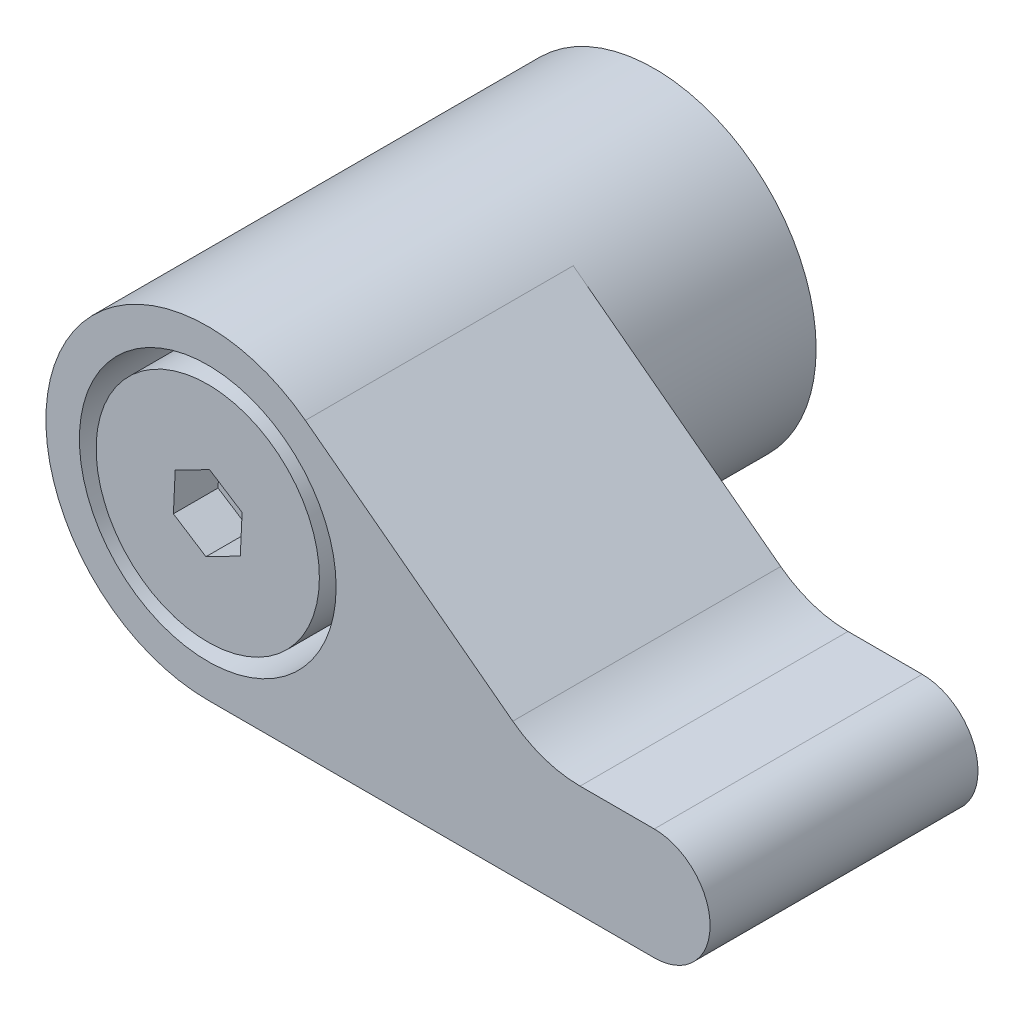
ISO-10303-21;
HEADER;
FILE_DESCRIPTION(('STEP AP214'),'2;1');
FILE_NAME('part.step','',(''),(''),'','','');
FILE_SCHEMA(('AUTOMOTIVE_DESIGN { 1 0 10303 214 1 1 1 1 }'));
ENDSEC;
DATA;
#1=APPLICATION_CONTEXT('core data for automotive mechanical design processes');
#2=APPLICATION_PROTOCOL_DEFINITION('international standard','automotive_design',2000,#1);
#3=PRODUCT_CONTEXT('',#1,'mechanical');
#4=PRODUCT('Part','Part','',(#3));
#5=PRODUCT_RELATED_PRODUCT_CATEGORY('part','',(#4));
#6=PRODUCT_DEFINITION_FORMATION('','',#4);
#7=PRODUCT_DEFINITION_CONTEXT('part definition',#1,'design');
#8=PRODUCT_DEFINITION('design','',#6,#7);
#9=PRODUCT_DEFINITION_SHAPE('','',#8);
#10=(LENGTH_UNIT() NAMED_UNIT(*) SI_UNIT(.MILLI.,.METRE.));
#11=(NAMED_UNIT(*) PLANE_ANGLE_UNIT() SI_UNIT($,.RADIAN.));
#12=(NAMED_UNIT(*) SI_UNIT($,.STERADIAN.) SOLID_ANGLE_UNIT());
#13=UNCERTAINTY_MEASURE_WITH_UNIT(LENGTH_MEASURE(1.E-05),#10,'distance_accuracy_value','');
#14=(GEOMETRIC_REPRESENTATION_CONTEXT(3) GLOBAL_UNCERTAINTY_ASSIGNED_CONTEXT((#13)) GLOBAL_UNIT_ASSIGNED_CONTEXT((#10,
#11,#12)) REPRESENTATION_CONTEXT('',''));
#15=CARTESIAN_POINT('',(0.,0.,0.));
#16=DIRECTION('',(0.,0.,1.));
#17=DIRECTION('',(1.,0.,0.));
#18=AXIS2_PLACEMENT_3D('',#15,#16,#17);
#19=CARTESIAN_POINT('',(0.,0.,10.));
#20=DIRECTION('',(0.,0.,1.));
#21=DIRECTION('',(1.,0.,0.));
#22=AXIS2_PLACEMENT_3D('',#19,#20,#21);
#23=PLANE('',#22);
#24=CARTESIAN_POINT('',(0.,0.,10.));
#25=DIRECTION('',(0.,0.,1.));
#26=DIRECTION('',(1.,0.,0.));
#27=AXIS2_PLACEMENT_3D('',#24,#25,#26);
#28=CIRCLE('',#27,5.75);
#29=CARTESIAN_POINT('',(5.75,0.,10.));
#30=VERTEX_POINT('',#29);
#31=EDGE_CURVE('E186',#30,#30,#28,.T.);
#32=ORIENTED_EDGE('',*,*,#31,.T.);
#33=EDGE_LOOP('',(#32));
#34=FACE_BOUND('',#33,.T.);
#35=CARTESIAN_POINT('',(0.,0.,10.));
#36=DIRECTION('',(0.,0.,1.));
#37=DIRECTION('',(1.,0.,0.));
#38=AXIS2_PLACEMENT_3D('',#35,#36,#37);
#39=CIRCLE('',#38,5.);
#40=CARTESIAN_POINT('',(5.,0.,10.));
#41=VERTEX_POINT('',#40);
#42=EDGE_CURVE('E172',#41,#41,#39,.T.);
#43=ORIENTED_EDGE('',*,*,#42,.F.);
#44=EDGE_LOOP('',(#43));
#45=FACE_BOUND('',#44,.T.);
#46=ADVANCED_FACE('F36',(#34,#45),#23,.T.);
#47=CARTESIAN_POINT('',(0.,0.,20.));
#48=DIRECTION('',(0.,0.,-1.));
#49=DIRECTION('',(-1.,0.,0.));
#50=AXIS2_PLACEMENT_3D('',#47,#48,#49);
#51=CYLINDRICAL_SURFACE('',#50,7.25);
#52=CARTESIAN_POINT('',(0.,0.,20.));
#53=DIRECTION('',(0.,0.,1.));
#54=DIRECTION('',(1.,0.,0.));
#55=AXIS2_PLACEMENT_3D('',#52,#53,#54);
#56=CIRCLE('',#55,7.25);
#57=CARTESIAN_POINT('',(4.3717142589399,5.78365061515489,20.));
#58=VERTEX_POINT('',#57);
#59=CARTESIAN_POINT('',(0.,-7.25,20.));
#60=VERTEX_POINT('',#59);
#61=EDGE_CURVE('E224',#58,#60,#56,.T.);
#62=ORIENTED_EDGE('',*,*,#61,.F.);
#63=DIRECTION('',(0.,0.,1.));
#64=VECTOR('',#63,1.);
#65=CARTESIAN_POINT('',(4.3717142589399,5.78365061515489,8.));
#66=LINE('',#65,#64);
#67=CARTESIAN_POINT('',(4.3717142589399,5.78365061515489,8.));
#68=VERTEX_POINT('',#67);
#69=EDGE_CURVE('E214',#68,#58,#66,.T.);
#70=ORIENTED_EDGE('',*,*,#69,.F.);
#71=CARTESIAN_POINT('',(0.,0.,8.));
#72=DIRECTION('',(0.,0.,1.));
#73=DIRECTION('',(1.,0.,0.));
#74=AXIS2_PLACEMENT_3D('',#71,#72,#73);
#75=CIRCLE('',#74,7.25);
#76=CARTESIAN_POINT('',(0.,-7.25,8.));
#77=VERTEX_POINT('',#76);
#78=EDGE_CURVE('E227',#77,#68,#75,.T.);
#79=ORIENTED_EDGE('',*,*,#78,.F.);
#80=DIRECTION('',(0.,0.,1.));
#81=VECTOR('',#80,1.);
#82=CARTESIAN_POINT('',(0.,-7.25,8.));
#83=LINE('',#82,#81);
#84=EDGE_CURVE('E204',#77,#60,#83,.T.);
#85=ORIENTED_EDGE('',*,*,#84,.T.);
#86=EDGE_LOOP('',(#62,#70,#79,#85));
#87=FACE_BOUND('',#86,.T.);
#88=CARTESIAN_POINT('',(0.,0.,0.));
#89=DIRECTION('',(0.,0.,1.));
#90=DIRECTION('',(1.,0.,0.));
#91=AXIS2_PLACEMENT_3D('',#88,#89,#90);
#92=CIRCLE('',#91,7.25);
#93=CARTESIAN_POINT('',(7.25,0.,0.));
#94=VERTEX_POINT('',#93);
#95=EDGE_CURVE('E217',#94,#94,#92,.T.);
#96=ORIENTED_EDGE('',*,*,#95,.T.);
#97=EDGE_LOOP('',(#96));
#98=FACE_BOUND('',#97,.T.);
#99=ADVANCED_FACE('F258',(#87,#98),#51,.T.);
#100=CARTESIAN_POINT('',(0.,0.,20.));
#101=DIRECTION('',(0.,0.,1.));
#102=DIRECTION('',(1.,0.,0.));
#103=AXIS2_PLACEMENT_3D('',#100,#101,#102);
#104=PLANE('',#103);
#105=CARTESIAN_POINT('',(0.,0.,20.));
#106=DIRECTION('',(0.,0.,1.));
#107=DIRECTION('',(1.,0.,0.));
#108=AXIS2_PLACEMENT_3D('',#105,#106,#107);
#109=CIRCLE('',#108,5.75);
#110=CARTESIAN_POINT('',(5.75,0.,20.));
#111=VERTEX_POINT('',#110);
#112=EDGE_CURVE('E185',#111,#111,#109,.T.);
#113=ORIENTED_EDGE('',*,*,#112,.F.);
#114=EDGE_LOOP('',(#113));
#115=FACE_BOUND('',#114,.T.);
#116=ORIENTED_EDGE('',*,*,#61,.T.);
#117=DIRECTION('',(1.,0.,0.));
#118=VECTOR('',#117,1.);
#119=CARTESIAN_POINT('',(0.,-7.25,20.));
#120=LINE('',#119,#118);
#121=CARTESIAN_POINT('',(20.,-7.25,20.));
#122=VERTEX_POINT('',#121);
#123=EDGE_CURVE('E189',#60,#122,#120,.T.);
#124=ORIENTED_EDGE('',*,*,#123,.T.);
#125=CARTESIAN_POINT('',(20.,-4.75,20.));
#126=DIRECTION('',(0.,0.,1.));
#127=DIRECTION('',(1.,0.,0.));
#128=AXIS2_PLACEMENT_3D('',#125,#126,#127);
#129=CIRCLE('',#128,2.5);
#130=CARTESIAN_POINT('',(20.,-2.25,20.));
#131=VERTEX_POINT('',#130);
#132=EDGE_CURVE('E207',#122,#131,#129,.T.);
#133=ORIENTED_EDGE('',*,*,#132,.T.);
#134=DIRECTION('',(-1.,0.,0.));
#135=VECTOR('',#134,1.);
#136=CARTESIAN_POINT('',(20.,-2.25,20.));
#137=LINE('',#136,#135);
#138=CARTESIAN_POINT('',(16.6770874055258,-2.25,20.));
#139=VERTEX_POINT('',#138);
#140=EDGE_CURVE('E210',#131,#139,#137,.T.);
#141=ORIENTED_EDGE('',*,*,#140,.T.);
#142=CARTESIAN_POINT('',(16.6770874055258,2.75,20.));
#143=DIRECTION('',(0.,0.,1.));
#144=DIRECTION('',(1.,0.,0.));
#145=AXIS2_PLACEMENT_3D('',#142,#143,#144);
#146=CIRCLE('',#145,5.);
#147=CARTESIAN_POINT('',(13.6621120545327,-1.23872456217579,20.));
#148=VERTEX_POINT('',#147);
#149=EDGE_CURVE('E44',#139,#148,#146,.F.);
#150=ORIENTED_EDGE('',*,*,#149,.T.);
#151=DIRECTION('',(-0.797744912435157,0.602995070198607,0.));
#152=VECTOR('',#151,1.);
#153=CARTESIAN_POINT('',(15.,-2.25,20.));
#154=LINE('',#153,#152);
#155=EDGE_CURVE('E196',#148,#58,#154,.T.);
#156=ORIENTED_EDGE('',*,*,#155,.T.);
#157=EDGE_LOOP('',(#116,#124,#133,#141,#150,#156));
#158=FACE_BOUND('',#157,.T.);
#159=ADVANCED_FACE('F236',(#115,#158),#104,.T.);
#160=CARTESIAN_POINT('',(0.,0.,0.));
#161=DIRECTION('',(0.,0.,1.));
#162=DIRECTION('',(1.,0.,0.));
#163=AXIS2_PLACEMENT_3D('',#160,#161,#162);
#164=PLANE('',#163);
#165=ORIENTED_EDGE('',*,*,#95,.F.);
#166=EDGE_LOOP('',(#165));
#167=FACE_BOUND('',#166,.T.);
#168=ADVANCED_FACE('F263',(#167),#164,.F.);
#169=CARTESIAN_POINT('',(0.,0.,8.));
#170=DIRECTION('',(0.,0.,1.));
#171=DIRECTION('',(1.,0.,0.));
#172=AXIS2_PLACEMENT_3D('',#169,#170,#171);
#173=PLANE('',#172);
#174=DIRECTION('',(1.,0.,0.));
#175=VECTOR('',#174,1.);
#176=CARTESIAN_POINT('',(0.,-7.25,8.));
#177=LINE('',#176,#175);
#178=CARTESIAN_POINT('',(20.,-7.25,8.));
#179=VERTEX_POINT('',#178);
#180=EDGE_CURVE('E192',#77,#179,#177,.T.);
#181=ORIENTED_EDGE('',*,*,#180,.F.);
#182=ORIENTED_EDGE('',*,*,#78,.T.);
#183=DIRECTION('',(-0.797744912435157,0.602995070198607,0.));
#184=VECTOR('',#183,1.);
#185=CARTESIAN_POINT('',(15.,-2.25,8.));
#186=LINE('',#185,#184);
#187=CARTESIAN_POINT('',(13.6621120545327,-1.23872456217579,8.));
#188=VERTEX_POINT('',#187);
#189=EDGE_CURVE('E202',#188,#68,#186,.T.);
#190=ORIENTED_EDGE('',*,*,#189,.F.);
#191=CARTESIAN_POINT('',(16.6770874055258,2.75,8.));
#192=DIRECTION('',(0.,0.,1.));
#193=DIRECTION('',(1.,0.,0.));
#194=AXIS2_PLACEMENT_3D('',#191,#192,#193);
#195=CIRCLE('',#194,5.);
#196=CARTESIAN_POINT('',(16.6770874055258,-2.25,8.));
#197=VERTEX_POINT('',#196);
#198=EDGE_CURVE('E11',#188,#197,#195,.T.);
#199=ORIENTED_EDGE('',*,*,#198,.T.);
#200=DIRECTION('',(-1.,0.,0.));
#201=VECTOR('',#200,1.);
#202=CARTESIAN_POINT('',(20.,-2.25,8.));
#203=LINE('',#202,#201);
#204=CARTESIAN_POINT('',(20.,-2.25,8.));
#205=VERTEX_POINT('',#204);
#206=EDGE_CURVE('E199',#205,#197,#203,.T.);
#207=ORIENTED_EDGE('',*,*,#206,.F.);
#208=CARTESIAN_POINT('',(20.,-4.75,8.));
#209=DIRECTION('',(0.,0.,1.));
#210=DIRECTION('',(1.,0.,0.));
#211=AXIS2_PLACEMENT_3D('',#208,#209,#210);
#212=CIRCLE('',#211,2.5);
#213=EDGE_CURVE('E195',#179,#205,#212,.T.);
#214=ORIENTED_EDGE('',*,*,#213,.F.);
#215=EDGE_LOOP('',(#181,#182,#190,#199,#207,#214));
#216=FACE_BOUND('',#215,.T.);
#217=ADVANCED_FACE('F247',(#216),#173,.F.);
#218=CARTESIAN_POINT('',(15.,-2.25,8.));
#219=DIRECTION('',(0.602995070198607,0.797744912435157,0.));
#220=DIRECTION('',(-0.797744912435158,0.602995070198607,0.));
#221=AXIS2_PLACEMENT_3D('',#218,#219,#220);
#222=PLANE('',#221);
#223=ORIENTED_EDGE('',*,*,#155,.F.);
#224=DIRECTION('',(0.,0.,1.));
#225=VECTOR('',#224,1.);
#226=CARTESIAN_POINT('',(13.6621120545327,-1.23872456217579,8.));
#227=LINE('',#226,#225);
#228=EDGE_CURVE('E59',#148,#188,#227,.F.);
#229=ORIENTED_EDGE('',*,*,#228,.T.);
#230=ORIENTED_EDGE('',*,*,#189,.T.);
#231=ORIENTED_EDGE('',*,*,#69,.T.);
#232=EDGE_LOOP('',(#223,#229,#230,#231));
#233=FACE_BOUND('',#232,.T.);
#234=ADVANCED_FACE('F240',(#233),#222,.T.);
#235=CARTESIAN_POINT('',(20.,-2.25,8.));
#236=DIRECTION('',(0.,1.,0.));
#237=DIRECTION('',(0.,0.,1.));
#238=AXIS2_PLACEMENT_3D('',#235,#236,#237);
#239=PLANE('',#238);
#240=ORIENTED_EDGE('',*,*,#206,.T.);
#241=DIRECTION('',(0.,0.,1.));
#242=VECTOR('',#241,1.);
#243=CARTESIAN_POINT('',(16.6770874055258,-2.25,20.));
#244=LINE('',#243,#242);
#245=EDGE_CURVE('E232',#197,#139,#244,.T.);
#246=ORIENTED_EDGE('',*,*,#245,.T.);
#247=ORIENTED_EDGE('',*,*,#140,.F.);
#248=DIRECTION('',(0.,0.,1.));
#249=VECTOR('',#248,1.);
#250=CARTESIAN_POINT('',(20.,-2.25,8.));
#251=LINE('',#250,#249);
#252=EDGE_CURVE('E218',#205,#131,#251,.T.);
#253=ORIENTED_EDGE('',*,*,#252,.F.);
#254=EDGE_LOOP('',(#240,#246,#247,#253));
#255=FACE_BOUND('',#254,.T.);
#256=ADVANCED_FACE('F250',(#255),#239,.T.);
#257=CARTESIAN_POINT('',(20.,-4.75,8.));
#258=DIRECTION('',(0.,0.,1.));
#259=DIRECTION('',(1.,0.,0.));
#260=AXIS2_PLACEMENT_3D('',#257,#258,#259);
#261=CYLINDRICAL_SURFACE('',#260,2.5);
#262=ORIENTED_EDGE('',*,*,#132,.F.);
#263=DIRECTION('',(0.,0.,1.));
#264=VECTOR('',#263,1.);
#265=CARTESIAN_POINT('',(20.,-7.25,8.));
#266=LINE('',#265,#264);
#267=EDGE_CURVE('E220',#179,#122,#266,.T.);
#268=ORIENTED_EDGE('',*,*,#267,.F.);
#269=ORIENTED_EDGE('',*,*,#213,.T.);
#270=ORIENTED_EDGE('',*,*,#252,.T.);
#271=EDGE_LOOP('',(#262,#268,#269,#270));
#272=FACE_BOUND('',#271,.T.);
#273=ADVANCED_FACE('F253',(#272),#261,.T.);
#274=CARTESIAN_POINT('',(0.,-7.25,8.));
#275=DIRECTION('',(0.,-1.,0.));
#276=DIRECTION('',(0.,0.,-1.));
#277=AXIS2_PLACEMENT_3D('',#274,#275,#276);
#278=PLANE('',#277);
#279=ORIENTED_EDGE('',*,*,#123,.F.);
#280=ORIENTED_EDGE('',*,*,#84,.F.);
#281=ORIENTED_EDGE('',*,*,#180,.T.);
#282=ORIENTED_EDGE('',*,*,#267,.T.);
#283=EDGE_LOOP('',(#279,#280,#281,#282));
#284=FACE_BOUND('',#283,.T.);
#285=ADVANCED_FACE('F256',(#284),#278,.T.);
#286=CARTESIAN_POINT('',(16.6770874055258,2.75,8.));
#287=DIRECTION('',(0.,0.,-1.));
#288=DIRECTION('',(-1.,0.,0.));
#289=AXIS2_PLACEMENT_3D('',#286,#287,#288);
#290=CYLINDRICAL_SURFACE('',#289,5.);
#291=ORIENTED_EDGE('',*,*,#198,.F.);
#292=ORIENTED_EDGE('',*,*,#228,.F.);
#293=ORIENTED_EDGE('',*,*,#149,.F.);
#294=ORIENTED_EDGE('',*,*,#245,.F.);
#295=EDGE_LOOP('',(#291,#292,#293,#294));
#296=FACE_BOUND('',#295,.T.);
#297=ADVANCED_FACE('F38',(#296),#290,.F.);
#298=CARTESIAN_POINT('',(0.,0.,10.));
#299=DIRECTION('',(0.,0.,1.));
#300=DIRECTION('',(1.,0.,0.));
#301=AXIS2_PLACEMENT_3D('',#298,#299,#300);
#302=CYLINDRICAL_SURFACE('',#301,5.75);
#303=ORIENTED_EDGE('',*,*,#31,.F.);
#304=EDGE_LOOP('',(#303));
#305=FACE_BOUND('',#304,.T.);
#306=ORIENTED_EDGE('',*,*,#112,.T.);
#307=EDGE_LOOP('',(#306));
#308=FACE_BOUND('',#307,.T.);
#309=ADVANCED_FACE('F283',(#305,#308),#302,.F.);
#310=CARTESIAN_POINT('',(0.,0.,34.142135623731));
#311=DIRECTION('',(0.,0.,-1.));
#312=DIRECTION('',(-1.,0.,0.));
#313=AXIS2_PLACEMENT_3D('',#310,#311,#312);
#314=CYLINDRICAL_SURFACE('',#313,5.);
#315=ORIENTED_EDGE('',*,*,#42,.T.);
#316=EDGE_LOOP('',(#315));
#317=FACE_BOUND('',#316,.T.);
#318=CARTESIAN_POINT('',(0.,0.,20.));
#319=DIRECTION('',(0.,0.,1.));
#320=DIRECTION('',(1.,0.,0.));
#321=AXIS2_PLACEMENT_3D('',#318,#319,#320);
#322=CIRCLE('',#321,5.);
#323=CARTESIAN_POINT('',(5.,0.,20.));
#324=VERTEX_POINT('',#323);
#325=EDGE_CURVE('E182',#324,#324,#322,.T.);
#326=ORIENTED_EDGE('',*,*,#325,.F.);
#327=EDGE_LOOP('',(#326));
#328=FACE_BOUND('',#327,.T.);
#329=ADVANCED_FACE('F285',(#317,#328),#314,.T.);
#330=CARTESIAN_POINT('',(0.,0.,20.));
#331=DIRECTION('',(0.,0.,1.));
#332=DIRECTION('',(1.,0.,0.));
#333=AXIS2_PLACEMENT_3D('',#330,#331,#332);
#334=PLANE('',#333);
#335=DIRECTION('',(0.888398265467521,0.459073547391155,0.));
#336=VECTOR('',#335,1.);
#337=CARTESIAN_POINT('',(-0.0807651454861721,-1.73016675244746,20.));
#338=LINE('',#337,#336);
#339=CARTESIAN_POINT('',(-0.0807651454861721,-1.73016675244746,20.));
#340=VERTEX_POINT('',#339);
#341=CARTESIAN_POINT('',(1.45798578765964,-0.935028043955102,20.));
#342=VERTEX_POINT('',#341);
#343=EDGE_CURVE('E51',#340,#342,#338,.T.);
#344=ORIENTED_EDGE('',*,*,#343,.F.);
#345=DIRECTION('',(0.841768486979941,-0.539838692877328,0.));
#346=VECTOR('',#345,1.);
#347=CARTESIAN_POINT('',(-1.53875093314581,-0.79513870849236,20.));
#348=LINE('',#347,#346);
#349=CARTESIAN_POINT('',(-1.53875093314581,-0.79513870849236,20.));
#350=VERTEX_POINT('',#349);
#351=EDGE_CURVE('E146',#350,#340,#348,.T.);
#352=ORIENTED_EDGE('',*,*,#351,.F.);
#353=DIRECTION('',(-0.0466297784875807,-0.998912240268483,0.));
#354=VECTOR('',#353,1.);
#355=CARTESIAN_POINT('',(-1.45798578765964,0.935028043955102,20.));
#356=LINE('',#355,#354);
#357=CARTESIAN_POINT('',(-1.45798578765964,0.935028043955102,20.));
#358=VERTEX_POINT('',#357);
#359=EDGE_CURVE('E149',#358,#350,#356,.T.);
#360=ORIENTED_EDGE('',*,*,#359,.F.);
#361=DIRECTION('',(-0.888398265467522,-0.459073547391155,0.));
#362=VECTOR('',#361,1.);
#363=CARTESIAN_POINT('',(0.0807651454861726,1.73016675244746,20.));
#364=LINE('',#363,#362);
#365=CARTESIAN_POINT('',(0.0807651454861726,1.73016675244746,20.));
#366=VERTEX_POINT('',#365);
#367=EDGE_CURVE('E165',#366,#358,#364,.T.);
#368=ORIENTED_EDGE('',*,*,#367,.F.);
#369=DIRECTION('',(-0.841768486979941,0.539838692877328,0.));
#370=VECTOR('',#369,1.);
#371=CARTESIAN_POINT('',(1.53875093314581,0.79513870849236,20.));
#372=LINE('',#371,#370);
#373=CARTESIAN_POINT('',(1.53875093314581,0.79513870849236,20.));
#374=VERTEX_POINT('',#373);
#375=EDGE_CURVE('E162',#374,#366,#372,.T.);
#376=ORIENTED_EDGE('',*,*,#375,.F.);
#377=DIRECTION('',(0.0466297784875807,0.998912240268483,0.));
#378=VECTOR('',#377,1.);
#379=CARTESIAN_POINT('',(1.45798578765964,-0.935028043955102,20.));
#380=LINE('',#379,#378);
#381=EDGE_CURVE('E160',#342,#374,#380,.T.);
#382=ORIENTED_EDGE('',*,*,#381,.F.);
#383=EDGE_LOOP('',(#344,#352,#360,#368,#376,#382));
#384=FACE_BOUND('',#383,.T.);
#385=ORIENTED_EDGE('',*,*,#325,.T.);
#386=EDGE_LOOP('',(#385));
#387=FACE_BOUND('',#386,.T.);
#388=ADVANCED_FACE('F281',(#384,#387),#334,.T.);
#389=CARTESIAN_POINT('',(-0.0807651454861721,-1.73016675244746,18.));
#390=DIRECTION('',(0.459073547391155,-0.888398265467521,0.));
#391=DIRECTION('',(0.888398265467522,0.459073547391155,0.));
#392=AXIS2_PLACEMENT_3D('',#389,#390,#391);
#393=PLANE('',#392);
#394=ORIENTED_EDGE('',*,*,#343,.T.);
#395=DIRECTION('',(0.,0.,1.));
#396=VECTOR('',#395,1.);
#397=CARTESIAN_POINT('',(1.45798578765964,-0.935028043955102,18.));
#398=LINE('',#397,#396);
#399=CARTESIAN_POINT('',(1.45798578765964,-0.935028043955102,18.));
#400=VERTEX_POINT('',#399);
#401=EDGE_CURVE('E123',#400,#342,#398,.T.);
#402=ORIENTED_EDGE('',*,*,#401,.F.);
#403=DIRECTION('',(0.888398265467521,0.459073547391155,0.));
#404=VECTOR('',#403,1.);
#405=CARTESIAN_POINT('',(-0.0807651454861721,-1.73016675244746,18.));
#406=LINE('',#405,#404);
#407=CARTESIAN_POINT('',(-0.0807651454861721,-1.73016675244746,18.));
#408=VERTEX_POINT('',#407);
#409=EDGE_CURVE('E127',#408,#400,#406,.T.);
#410=ORIENTED_EDGE('',*,*,#409,.F.);
#411=DIRECTION('',(0.,0.,1.));
#412=VECTOR('',#411,1.);
#413=CARTESIAN_POINT('',(-0.0807651454861721,-1.73016675244746,18.));
#414=LINE('',#413,#412);
#415=EDGE_CURVE('E170',#408,#340,#414,.T.);
#416=ORIENTED_EDGE('',*,*,#415,.T.);
#417=EDGE_LOOP('',(#394,#402,#410,#416));
#418=FACE_BOUND('',#417,.T.);
#419=ADVANCED_FACE('F125',(#418),#393,.F.);
#420=CARTESIAN_POINT('',(-1.53875093314581,-0.79513870849236,18.));
#421=DIRECTION('',(-0.539838692877328,-0.841768486979941,0.));
#422=DIRECTION('',(0.841768486979941,-0.539838692877328,0.));
#423=AXIS2_PLACEMENT_3D('',#420,#421,#422);
#424=PLANE('',#423);
#425=ORIENTED_EDGE('',*,*,#351,.T.);
#426=ORIENTED_EDGE('',*,*,#415,.F.);
#427=DIRECTION('',(0.841768486979941,-0.539838692877328,0.));
#428=VECTOR('',#427,1.);
#429=CARTESIAN_POINT('',(-1.53875093314581,-0.79513870849236,18.));
#430=LINE('',#429,#428);
#431=CARTESIAN_POINT('',(-1.53875093314581,-0.79513870849236,18.));
#432=VERTEX_POINT('',#431);
#433=EDGE_CURVE('E133',#432,#408,#430,.T.);
#434=ORIENTED_EDGE('',*,*,#433,.F.);
#435=DIRECTION('',(0.,0.,1.));
#436=VECTOR('',#435,1.);
#437=CARTESIAN_POINT('',(-1.53875093314581,-0.79513870849236,18.));
#438=LINE('',#437,#436);
#439=EDGE_CURVE('E173',#432,#350,#438,.T.);
#440=ORIENTED_EDGE('',*,*,#439,.T.);
#441=EDGE_LOOP('',(#425,#426,#434,#440));
#442=FACE_BOUND('',#441,.T.);
#443=ADVANCED_FACE('F324',(#442),#424,.F.);
#444=CARTESIAN_POINT('',(-1.45798578765964,0.935028043955102,18.));
#445=DIRECTION('',(-0.998912240268483,0.0466297784875807,0.));
#446=DIRECTION('',(-0.0466297784875807,-0.998912240268483,0.));
#447=AXIS2_PLACEMENT_3D('',#444,#445,#446);
#448=PLANE('',#447);
#449=ORIENTED_EDGE('',*,*,#359,.T.);
#450=ORIENTED_EDGE('',*,*,#439,.F.);
#451=DIRECTION('',(-0.0466297784875807,-0.998912240268483,0.));
#452=VECTOR('',#451,1.);
#453=CARTESIAN_POINT('',(-1.45798578765964,0.935028043955102,18.));
#454=LINE('',#453,#452);
#455=CARTESIAN_POINT('',(-1.45798578765964,0.935028043955102,18.));
#456=VERTEX_POINT('',#455);
#457=EDGE_CURVE('E156',#456,#432,#454,.T.);
#458=ORIENTED_EDGE('',*,*,#457,.F.);
#459=DIRECTION('',(0.,0.,1.));
#460=VECTOR('',#459,1.);
#461=CARTESIAN_POINT('',(-1.45798578765964,0.935028043955102,18.));
#462=LINE('',#461,#460);
#463=EDGE_CURVE('E175',#456,#358,#462,.T.);
#464=ORIENTED_EDGE('',*,*,#463,.T.);
#465=EDGE_LOOP('',(#449,#450,#458,#464));
#466=FACE_BOUND('',#465,.T.);
#467=ADVANCED_FACE('F331',(#466),#448,.F.);
#468=CARTESIAN_POINT('',(0.0807651454861726,1.73016675244746,18.));
#469=DIRECTION('',(-0.459073547391155,0.888398265467522,0.));
#470=DIRECTION('',(-0.888398265467522,-0.459073547391155,0.));
#471=AXIS2_PLACEMENT_3D('',#468,#469,#470);
#472=PLANE('',#471);
#473=ORIENTED_EDGE('',*,*,#367,.T.);
#474=ORIENTED_EDGE('',*,*,#463,.F.);
#475=DIRECTION('',(-0.888398265467522,-0.459073547391155,0.));
#476=VECTOR('',#475,1.);
#477=CARTESIAN_POINT('',(0.0807651454861726,1.73016675244746,18.));
#478=LINE('',#477,#476);
#479=CARTESIAN_POINT('',(0.0807651454861726,1.73016675244746,18.));
#480=VERTEX_POINT('',#479);
#481=EDGE_CURVE('E153',#480,#456,#478,.T.);
#482=ORIENTED_EDGE('',*,*,#481,.F.);
#483=DIRECTION('',(0.,0.,1.));
#484=VECTOR('',#483,1.);
#485=CARTESIAN_POINT('',(0.0807651454861726,1.73016675244746,18.));
#486=LINE('',#485,#484);
#487=EDGE_CURVE('E177',#480,#366,#486,.T.);
#488=ORIENTED_EDGE('',*,*,#487,.T.);
#489=EDGE_LOOP('',(#473,#474,#482,#488));
#490=FACE_BOUND('',#489,.T.);
#491=ADVANCED_FACE('F339',(#490),#472,.F.);
#492=CARTESIAN_POINT('',(1.53875093314581,0.79513870849236,18.));
#493=DIRECTION('',(0.539838692877328,0.841768486979941,0.));
#494=DIRECTION('',(-0.841768486979941,0.539838692877328,0.));
#495=AXIS2_PLACEMENT_3D('',#492,#493,#494);
#496=PLANE('',#495);
#497=ORIENTED_EDGE('',*,*,#375,.T.);
#498=ORIENTED_EDGE('',*,*,#487,.F.);
#499=DIRECTION('',(-0.841768486979941,0.539838692877328,0.));
#500=VECTOR('',#499,1.);
#501=CARTESIAN_POINT('',(1.53875093314581,0.79513870849236,18.));
#502=LINE('',#501,#500);
#503=CARTESIAN_POINT('',(1.53875093314581,0.79513870849236,18.));
#504=VERTEX_POINT('',#503);
#505=EDGE_CURVE('E141',#504,#480,#502,.T.);
#506=ORIENTED_EDGE('',*,*,#505,.F.);
#507=DIRECTION('',(0.,0.,1.));
#508=VECTOR('',#507,1.);
#509=CARTESIAN_POINT('',(1.53875093314581,0.79513870849236,18.));
#510=LINE('',#509,#508);
#511=EDGE_CURVE('E132',#504,#374,#510,.T.);
#512=ORIENTED_EDGE('',*,*,#511,.T.);
#513=EDGE_LOOP('',(#497,#498,#506,#512));
#514=FACE_BOUND('',#513,.T.);
#515=ADVANCED_FACE('F347',(#514),#496,.F.);
#516=CARTESIAN_POINT('',(1.45798578765964,-0.935028043955102,18.));
#517=DIRECTION('',(0.998912240268483,-0.0466297784875807,0.));
#518=DIRECTION('',(0.0466297784875807,0.998912240268483,0.));
#519=AXIS2_PLACEMENT_3D('',#516,#517,#518);
#520=PLANE('',#519);
#521=ORIENTED_EDGE('',*,*,#381,.T.);
#522=ORIENTED_EDGE('',*,*,#511,.F.);
#523=DIRECTION('',(0.0466297784875807,0.998912240268483,0.));
#524=VECTOR('',#523,1.);
#525=CARTESIAN_POINT('',(1.45798578765964,-0.935028043955102,18.));
#526=LINE('',#525,#524);
#527=EDGE_CURVE('E136',#400,#504,#526,.T.);
#528=ORIENTED_EDGE('',*,*,#527,.F.);
#529=ORIENTED_EDGE('',*,*,#401,.T.);
#530=EDGE_LOOP('',(#521,#522,#528,#529));
#531=FACE_BOUND('',#530,.T.);
#532=ADVANCED_FACE('F137',(#531),#520,.F.);
#533=CARTESIAN_POINT('',(0.,0.,18.));
#534=DIRECTION('',(0.,0.,1.));
#535=DIRECTION('',(1.,0.,0.));
#536=AXIS2_PLACEMENT_3D('',#533,#534,#535);
#537=PLANE('',#536);
#538=ORIENTED_EDGE('',*,*,#409,.T.);
#539=ORIENTED_EDGE('',*,*,#527,.T.);
#540=ORIENTED_EDGE('',*,*,#505,.T.);
#541=ORIENTED_EDGE('',*,*,#481,.T.);
#542=ORIENTED_EDGE('',*,*,#457,.T.);
#543=ORIENTED_EDGE('',*,*,#433,.T.);
#544=EDGE_LOOP('',(#538,#539,#540,#541,#542,#543));
#545=FACE_BOUND('',#544,.T.);
#546=ADVANCED_FACE('F143',(#545),#537,.T.);
#547=CLOSED_SHELL('',(#46,#99,#159,#168,#217,#234,#256,#273,#285,#297,#309,#329,#388,#419,#443,
#467,#491,#515,#532,#546));
#548=MANIFOLD_SOLID_BREP('B2',#547);
#549=ADVANCED_BREP_SHAPE_REPRESENTATION('',(#18,#548),#14);
#550=SHAPE_DEFINITION_REPRESENTATION(#9,#549);
ENDSEC;
END-ISO-10303-21;
